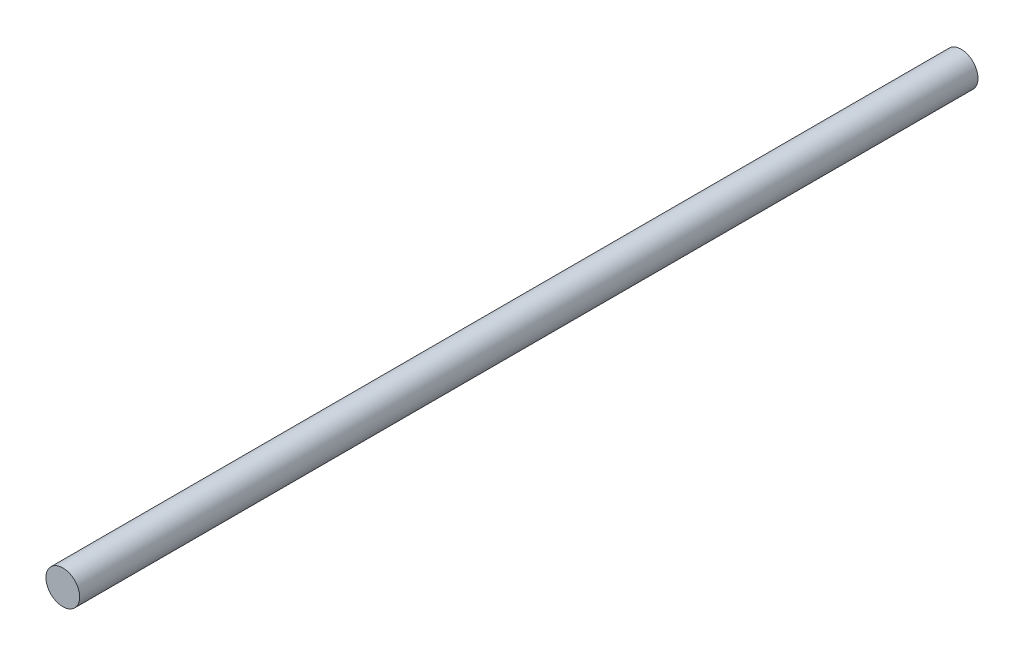
ISO-10303-21;
HEADER;
FILE_DESCRIPTION(('STEP AP214'),'2;1');
FILE_NAME('part.step','',(''),(''),'','','');
FILE_SCHEMA(('AUTOMOTIVE_DESIGN { 1 0 10303 214 1 1 1 1 }'));
ENDSEC;
DATA;
#1=APPLICATION_CONTEXT('core data for automotive mechanical design processes');
#2=APPLICATION_PROTOCOL_DEFINITION('international standard','automotive_design',2000,#1);
#3=PRODUCT_CONTEXT('',#1,'mechanical');
#4=PRODUCT('Part','Part','',(#3));
#5=PRODUCT_RELATED_PRODUCT_CATEGORY('part','',(#4));
#6=PRODUCT_DEFINITION_FORMATION('','',#4);
#7=PRODUCT_DEFINITION_CONTEXT('part definition',#1,'design');
#8=PRODUCT_DEFINITION('design','',#6,#7);
#9=PRODUCT_DEFINITION_SHAPE('','',#8);
#10=(LENGTH_UNIT() NAMED_UNIT(*) SI_UNIT(.MILLI.,.METRE.));
#11=(NAMED_UNIT(*) PLANE_ANGLE_UNIT() SI_UNIT($,.RADIAN.));
#12=(NAMED_UNIT(*) SI_UNIT($,.STERADIAN.) SOLID_ANGLE_UNIT());
#13=UNCERTAINTY_MEASURE_WITH_UNIT(LENGTH_MEASURE(1.E-05),#10,'distance_accuracy_value','');
#14=(GEOMETRIC_REPRESENTATION_CONTEXT(3) GLOBAL_UNCERTAINTY_ASSIGNED_CONTEXT((#13)) GLOBAL_UNIT_ASSIGNED_CONTEXT((#10,
#11,#12)) REPRESENTATION_CONTEXT('',''));
#15=CARTESIAN_POINT('',(0.,0.,0.));
#16=DIRECTION('',(0.,0.,1.));
#17=DIRECTION('',(1.,0.,0.));
#18=AXIS2_PLACEMENT_3D('',#15,#16,#17);
#19=CARTESIAN_POINT('',(0.,0.,-127.));
#20=DIRECTION('',(0.,0.,1.));
#21=DIRECTION('',(1.,0.,0.));
#22=AXIS2_PLACEMENT_3D('',#19,#20,#21);
#23=CYLINDRICAL_SURFACE('',#22,2.38125);
#24=CARTESIAN_POINT('',(0.,0.,-127.));
#25=DIRECTION('',(0.,0.,1.));
#26=DIRECTION('',(1.,0.,0.));
#27=AXIS2_PLACEMENT_3D('',#24,#25,#26);
#28=CIRCLE('',#27,2.38125);
#29=CARTESIAN_POINT('',(2.38125,0.,-127.));
#30=VERTEX_POINT('',#29);
#31=EDGE_CURVE('E10',#30,#30,#28,.T.);
#32=ORIENTED_EDGE('',*,*,#31,.T.);
#33=EDGE_LOOP('',(#32));
#34=FACE_BOUND('',#33,.T.);
#35=CARTESIAN_POINT('',(0.,0.,0.));
#36=DIRECTION('',(0.,0.,1.));
#37=DIRECTION('',(1.,0.,0.));
#38=AXIS2_PLACEMENT_3D('',#35,#36,#37);
#39=CIRCLE('',#38,2.38125);
#40=CARTESIAN_POINT('',(2.38125,0.,0.));
#41=VERTEX_POINT('',#40);
#42=EDGE_CURVE('E33',#41,#41,#39,.T.);
#43=ORIENTED_EDGE('',*,*,#42,.F.);
#44=EDGE_LOOP('',(#43));
#45=FACE_BOUND('',#44,.T.);
#46=ADVANCED_FACE('F30',(#34,#45),#23,.T.);
#47=CARTESIAN_POINT('',(0.,0.,-127.));
#48=DIRECTION('',(0.,0.,1.));
#49=DIRECTION('',(1.,0.,0.));
#50=AXIS2_PLACEMENT_3D('',#47,#48,#49);
#51=PLANE('',#50);
#52=ORIENTED_EDGE('',*,*,#31,.F.);
#53=EDGE_LOOP('',(#52));
#54=FACE_BOUND('',#53,.T.);
#55=ADVANCED_FACE('F45',(#54),#51,.F.);
#56=CARTESIAN_POINT('',(0.,0.,0.));
#57=DIRECTION('',(0.,0.,1.));
#58=DIRECTION('',(1.,0.,0.));
#59=AXIS2_PLACEMENT_3D('',#56,#57,#58);
#60=PLANE('',#59);
#61=ORIENTED_EDGE('',*,*,#42,.T.);
#62=EDGE_LOOP('',(#61));
#63=FACE_BOUND('',#62,.T.);
#64=ADVANCED_FACE('F42',(#63),#60,.T.);
#65=CLOSED_SHELL('',(#46,#55,#64));
#66=MANIFOLD_SOLID_BREP('B2',#65);
#67=ADVANCED_BREP_SHAPE_REPRESENTATION('',(#18,#66),#14);
#68=SHAPE_DEFINITION_REPRESENTATION(#9,#67);
ENDSEC;
END-ISO-10303-21;
